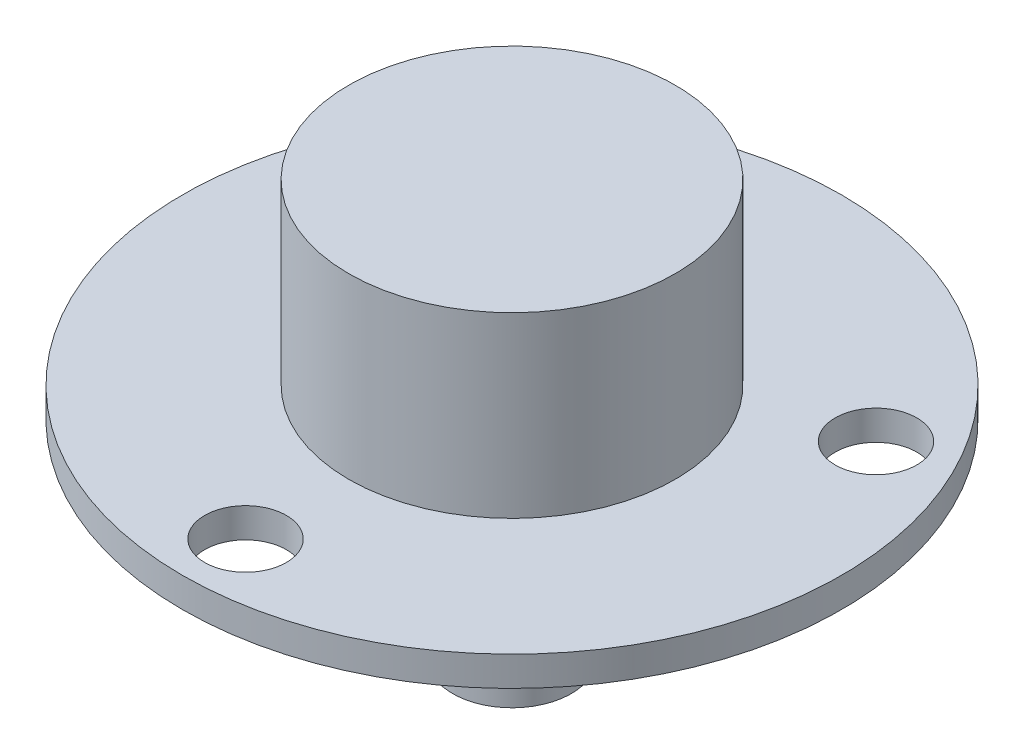
ISO-10303-21;
HEADER;
FILE_DESCRIPTION(('STEP AP214'),'2;1');
FILE_NAME('part.step','',(''),(''),'','','');
FILE_SCHEMA(('AUTOMOTIVE_DESIGN { 1 0 10303 214 1 1 1 1 }'));
ENDSEC;
DATA;
#1=APPLICATION_CONTEXT('core data for automotive mechanical design processes');
#2=APPLICATION_PROTOCOL_DEFINITION('international standard','automotive_design',2000,#1);
#3=PRODUCT_CONTEXT('',#1,'mechanical');
#4=PRODUCT('Part','Part','',(#3));
#5=PRODUCT_RELATED_PRODUCT_CATEGORY('part','',(#4));
#6=PRODUCT_DEFINITION_FORMATION('','',#4);
#7=PRODUCT_DEFINITION_CONTEXT('part definition',#1,'design');
#8=PRODUCT_DEFINITION('design','',#6,#7);
#9=PRODUCT_DEFINITION_SHAPE('','',#8);
#10=(LENGTH_UNIT() NAMED_UNIT(*) SI_UNIT(.MILLI.,.METRE.));
#11=(NAMED_UNIT(*) PLANE_ANGLE_UNIT() SI_UNIT($,.RADIAN.));
#12=(NAMED_UNIT(*) SI_UNIT($,.STERADIAN.) SOLID_ANGLE_UNIT());
#13=UNCERTAINTY_MEASURE_WITH_UNIT(LENGTH_MEASURE(1.E-05),#10,'distance_accuracy_value','');
#14=(GEOMETRIC_REPRESENTATION_CONTEXT(3) GLOBAL_UNCERTAINTY_ASSIGNED_CONTEXT((#13)) GLOBAL_UNIT_ASSIGNED_CONTEXT((#10,
#11,#12)) REPRESENTATION_CONTEXT('',''));
#15=CARTESIAN_POINT('',(0.,0.,0.));
#16=DIRECTION('',(0.,0.,1.));
#17=DIRECTION('',(1.,0.,0.));
#18=AXIS2_PLACEMENT_3D('',#15,#16,#17);
#19=CARTESIAN_POINT('',(0.,2.,0.));
#20=DIRECTION('',(0.,-1.,0.));
#21=DIRECTION('',(0.,0.,-1.));
#22=AXIS2_PLACEMENT_3D('',#19,#20,#21);
#23=CYLINDRICAL_SURFACE('',#22,22.2);
#24=CARTESIAN_POINT('',(0.,2.,0.));
#25=DIRECTION('',(0.,1.,0.));
#26=DIRECTION('',(0.,0.,1.));
#27=AXIS2_PLACEMENT_3D('',#24,#25,#26);
#28=CIRCLE('',#27,22.2);
#29=CARTESIAN_POINT('',(0.,2.,22.2));
#30=VERTEX_POINT('',#29);
#31=EDGE_CURVE('E42',#30,#30,#28,.T.);
#32=ORIENTED_EDGE('',*,*,#31,.F.);
#33=EDGE_LOOP('',(#32));
#34=FACE_BOUND('',#33,.T.);
#35=CARTESIAN_POINT('',(0.,0.,0.));
#36=DIRECTION('',(0.,1.,0.));
#37=DIRECTION('',(0.,0.,1.));
#38=AXIS2_PLACEMENT_3D('',#35,#36,#37);
#39=CIRCLE('',#38,22.2);
#40=CARTESIAN_POINT('',(0.,0.,22.2));
#41=VERTEX_POINT('',#40);
#42=EDGE_CURVE('E54',#41,#41,#39,.T.);
#43=ORIENTED_EDGE('',*,*,#42,.T.);
#44=EDGE_LOOP('',(#43));
#45=FACE_BOUND('',#44,.T.);
#46=ADVANCED_FACE('F30',(#34,#45),#23,.T.);
#47=CARTESIAN_POINT('',(0.,2.,0.));
#48=DIRECTION('',(0.,1.,0.));
#49=DIRECTION('',(0.,0.,1.));
#50=AXIS2_PLACEMENT_3D('',#47,#48,#49);
#51=PLANE('',#50);
#52=CARTESIAN_POINT('',(0.,2.,17.95));
#53=DIRECTION('',(0.,1.,0.));
#54=DIRECTION('',(0.,0.,1.));
#55=AXIS2_PLACEMENT_3D('',#52,#53,#54);
#56=CIRCLE('',#55,2.75);
#57=CARTESIAN_POINT('',(0.,2.,20.7));
#58=VERTEX_POINT('',#57);
#59=EDGE_CURVE('E65',#58,#58,#56,.T.);
#60=ORIENTED_EDGE('',*,*,#59,.F.);
#61=EDGE_LOOP('',(#60));
#62=FACE_BOUND('',#61,.T.);
#63=CARTESIAN_POINT('',(-15.5451559979306,2.,-8.97500000000008));
#64=DIRECTION('',(0.,1.,0.));
#65=DIRECTION('',(0.,0.,1.));
#66=AXIS2_PLACEMENT_3D('',#63,#64,#65);
#67=CIRCLE('',#66,2.75);
#68=CARTESIAN_POINT('',(-15.5451559979306,2.,-6.22500000000008));
#69=VERTEX_POINT('',#68);
#70=EDGE_CURVE('E188',#69,#69,#67,.T.);
#71=ORIENTED_EDGE('',*,*,#70,.F.);
#72=EDGE_LOOP('',(#71));
#73=FACE_BOUND('',#72,.T.);
#74=CARTESIAN_POINT('',(15.5451559979308,2.,-8.97499999999986));
#75=DIRECTION('',(0.,1.,0.));
#76=DIRECTION('',(0.,0.,1.));
#77=AXIS2_PLACEMENT_3D('',#74,#75,#76);
#78=CIRCLE('',#77,2.75);
#79=CARTESIAN_POINT('',(15.5451559979308,2.,-6.22499999999986));
#80=VERTEX_POINT('',#79);
#81=EDGE_CURVE('E191',#80,#80,#78,.T.);
#82=ORIENTED_EDGE('',*,*,#81,.F.);
#83=EDGE_LOOP('',(#82));
#84=FACE_BOUND('',#83,.T.);
#85=CARTESIAN_POINT('',(0.,2.,0.));
#86=DIRECTION('',(0.,1.,0.));
#87=DIRECTION('',(0.,0.,1.));
#88=AXIS2_PLACEMENT_3D('',#85,#86,#87);
#89=CIRCLE('',#88,11.);
#90=CARTESIAN_POINT('',(0.,2.,11.));
#91=VERTEX_POINT('',#90);
#92=EDGE_CURVE('E37',#91,#91,#89,.T.);
#93=ORIENTED_EDGE('',*,*,#92,.F.);
#94=EDGE_LOOP('',(#93));
#95=FACE_BOUND('',#94,.T.);
#96=ORIENTED_EDGE('',*,*,#31,.T.);
#97=EDGE_LOOP('',(#96));
#98=FACE_BOUND('',#97,.T.);
#99=ADVANCED_FACE('F91',(#62,#73,#84,#95,#98),#51,.T.);
#100=CARTESIAN_POINT('',(0.,0.,0.));
#101=DIRECTION('',(0.,1.,0.));
#102=DIRECTION('',(0.,0.,1.));
#103=AXIS2_PLACEMENT_3D('',#100,#101,#102);
#104=PLANE('',#103);
#105=CARTESIAN_POINT('',(0.,0.,17.95));
#106=DIRECTION('',(0.,1.,0.));
#107=DIRECTION('',(0.,0.,1.));
#108=AXIS2_PLACEMENT_3D('',#105,#106,#107);
#109=CIRCLE('',#108,2.75);
#110=CARTESIAN_POINT('',(0.,0.,20.7));
#111=VERTEX_POINT('',#110);
#112=EDGE_CURVE('E33',#111,#111,#109,.T.);
#113=ORIENTED_EDGE('',*,*,#112,.T.);
#114=EDGE_LOOP('',(#113));
#115=FACE_BOUND('',#114,.T.);
#116=CARTESIAN_POINT('',(-15.5451559979306,0.,-8.97500000000008));
#117=DIRECTION('',(0.,1.,0.));
#118=DIRECTION('',(0.,0.,1.));
#119=AXIS2_PLACEMENT_3D('',#116,#117,#118);
#120=CIRCLE('',#119,2.75);
#121=CARTESIAN_POINT('',(-15.5451559979306,0.,-6.22500000000008));
#122=VERTEX_POINT('',#121);
#123=EDGE_CURVE('E64',#122,#122,#120,.T.);
#124=ORIENTED_EDGE('',*,*,#123,.T.);
#125=EDGE_LOOP('',(#124));
#126=FACE_BOUND('',#125,.T.);
#127=CARTESIAN_POINT('',(15.5451559979308,0.,-8.97499999999986));
#128=DIRECTION('',(0.,1.,0.));
#129=DIRECTION('',(0.,0.,1.));
#130=AXIS2_PLACEMENT_3D('',#127,#128,#129);
#131=CIRCLE('',#130,2.75);
#132=CARTESIAN_POINT('',(15.5451559979308,0.,-6.22499999999986));
#133=VERTEX_POINT('',#132);
#134=EDGE_CURVE('E62',#133,#133,#131,.T.);
#135=ORIENTED_EDGE('',*,*,#134,.T.);
#136=EDGE_LOOP('',(#135));
#137=FACE_BOUND('',#136,.T.);
#138=CARTESIAN_POINT('',(0.,0.,0.));
#139=DIRECTION('',(0.,1.,0.));
#140=DIRECTION('',(0.,0.,1.));
#141=AXIS2_PLACEMENT_3D('',#138,#139,#140);
#142=CIRCLE('',#141,11.);
#143=CARTESIAN_POINT('',(0.,0.,11.));
#144=VERTEX_POINT('',#143);
#145=EDGE_CURVE('E51',#144,#144,#142,.T.);
#146=ORIENTED_EDGE('',*,*,#145,.T.);
#147=EDGE_LOOP('',(#146));
#148=FACE_BOUND('',#147,.T.);
#149=ORIENTED_EDGE('',*,*,#42,.F.);
#150=EDGE_LOOP('',(#149));
#151=FACE_BOUND('',#150,.T.);
#152=ADVANCED_FACE('F96',(#115,#126,#137,#148,#151),#104,.F.);
#153=CARTESIAN_POINT('',(0.,14.,0.));
#154=DIRECTION('',(0.,-1.,0.));
#155=DIRECTION('',(0.,0.,-1.));
#156=AXIS2_PLACEMENT_3D('',#153,#154,#155);
#157=CYLINDRICAL_SURFACE('',#156,11.);
#158=CARTESIAN_POINT('',(0.,14.,0.));
#159=DIRECTION('',(0.,1.,0.));
#160=DIRECTION('',(0.,0.,1.));
#161=AXIS2_PLACEMENT_3D('',#158,#159,#160);
#162=CIRCLE('',#161,11.);
#163=CARTESIAN_POINT('',(0.,14.,11.));
#164=VERTEX_POINT('',#163);
#165=EDGE_CURVE('E52',#164,#164,#162,.T.);
#166=ORIENTED_EDGE('',*,*,#165,.F.);
#167=EDGE_LOOP('',(#166));
#168=FACE_BOUND('',#167,.T.);
#169=ORIENTED_EDGE('',*,*,#92,.T.);
#170=EDGE_LOOP('',(#169));
#171=FACE_BOUND('',#170,.T.);
#172=ADVANCED_FACE('F104',(#168,#171),#157,.T.);
#173=CARTESIAN_POINT('',(0.,14.,0.));
#174=DIRECTION('',(0.,1.,0.));
#175=DIRECTION('',(0.,0.,1.));
#176=AXIS2_PLACEMENT_3D('',#173,#174,#175);
#177=PLANE('',#176);
#178=ORIENTED_EDGE('',*,*,#165,.T.);
#179=EDGE_LOOP('',(#178));
#180=FACE_BOUND('',#179,.T.);
#181=ADVANCED_FACE('F108',(#180),#177,.T.);
#182=CARTESIAN_POINT('',(0.,-5.,0.));
#183=DIRECTION('',(0.,1.,0.));
#184=DIRECTION('',(0.,0.,1.));
#185=AXIS2_PLACEMENT_3D('',#182,#183,#184);
#186=CYLINDRICAL_SURFACE('',#185,11.);
#187=CARTESIAN_POINT('',(0.,-5.,0.));
#188=DIRECTION('',(0.,1.,0.));
#189=DIRECTION('',(0.,0.,1.));
#190=AXIS2_PLACEMENT_3D('',#187,#188,#189);
#191=CIRCLE('',#190,11.);
#192=CARTESIAN_POINT('',(0.,-5.,11.));
#193=VERTEX_POINT('',#192);
#194=EDGE_CURVE('E48',#193,#193,#191,.T.);
#195=ORIENTED_EDGE('',*,*,#194,.T.);
#196=EDGE_LOOP('',(#195));
#197=FACE_BOUND('',#196,.T.);
#198=ORIENTED_EDGE('',*,*,#145,.F.);
#199=EDGE_LOOP('',(#198));
#200=FACE_BOUND('',#199,.T.);
#201=ADVANCED_FACE('F87',(#197,#200),#186,.T.);
#202=CARTESIAN_POINT('',(0.,-5.,0.));
#203=DIRECTION('',(0.,1.,0.));
#204=DIRECTION('',(0.,0.,1.));
#205=AXIS2_PLACEMENT_3D('',#202,#203,#204);
#206=PLANE('',#205);
#207=CARTESIAN_POINT('',(0.,-5.,0.));
#208=DIRECTION('',(0.,-1.,0.));
#209=DIRECTION('',(0.,0.,-1.));
#210=AXIS2_PLACEMENT_3D('',#207,#208,#209);
#211=CIRCLE('',#210,4.);
#212=CARTESIAN_POINT('',(0.,-5.,-4.));
#213=VERTEX_POINT('',#212);
#214=EDGE_CURVE('E10',#213,#213,#211,.T.);
#215=ORIENTED_EDGE('',*,*,#214,.F.);
#216=EDGE_LOOP('',(#215));
#217=FACE_BOUND('',#216,.T.);
#218=ORIENTED_EDGE('',*,*,#194,.F.);
#219=EDGE_LOOP('',(#218));
#220=FACE_BOUND('',#219,.T.);
#221=ADVANCED_FACE('F79',(#217,#220),#206,.F.);
#222=CARTESIAN_POINT('',(0.,-14.,0.));
#223=DIRECTION('',(0.,1.,0.));
#224=DIRECTION('',(0.,0.,1.));
#225=AXIS2_PLACEMENT_3D('',#222,#223,#224);
#226=CYLINDRICAL_SURFACE('',#225,4.);
#227=CARTESIAN_POINT('',(0.,-14.,0.));
#228=DIRECTION('',(0.,-1.,0.));
#229=DIRECTION('',(0.,0.,-1.));
#230=AXIS2_PLACEMENT_3D('',#227,#228,#229);
#231=CIRCLE('',#230,4.);
#232=CARTESIAN_POINT('',(0.,-14.,-4.));
#233=VERTEX_POINT('',#232);
#234=EDGE_CURVE('E46',#233,#233,#231,.T.);
#235=ORIENTED_EDGE('',*,*,#234,.F.);
#236=EDGE_LOOP('',(#235));
#237=FACE_BOUND('',#236,.T.);
#238=ORIENTED_EDGE('',*,*,#214,.T.);
#239=EDGE_LOOP('',(#238));
#240=FACE_BOUND('',#239,.T.);
#241=ADVANCED_FACE('F77',(#237,#240),#226,.T.);
#242=CARTESIAN_POINT('',(0.,-14.,0.));
#243=DIRECTION('',(0.,-1.,0.));
#244=DIRECTION('',(0.,0.,-1.));
#245=AXIS2_PLACEMENT_3D('',#242,#243,#244);
#246=PLANE('',#245);
#247=ORIENTED_EDGE('',*,*,#234,.T.);
#248=EDGE_LOOP('',(#247));
#249=FACE_BOUND('',#248,.T.);
#250=ADVANCED_FACE('F75',(#249),#246,.T.);
#251=CARTESIAN_POINT('',(15.5451559979308,-1.1,-8.97499999999986));
#252=DIRECTION('',(0.,1.,0.));
#253=DIRECTION('',(0.,0.,1.));
#254=AXIS2_PLACEMENT_3D('',#251,#252,#253);
#255=CYLINDRICAL_SURFACE('',#254,2.75);
#256=ORIENTED_EDGE('',*,*,#81,.T.);
#257=EDGE_LOOP('',(#256));
#258=FACE_BOUND('',#257,.T.);
#259=ORIENTED_EDGE('',*,*,#134,.F.);
#260=EDGE_LOOP('',(#259));
#261=FACE_BOUND('',#260,.T.);
#262=ADVANCED_FACE('F85',(#258,#261),#255,.F.);
#263=CARTESIAN_POINT('',(-15.5451559979306,-1.1,-8.97500000000008));
#264=DIRECTION('',(0.,1.,0.));
#265=DIRECTION('',(0.,0.,1.));
#266=AXIS2_PLACEMENT_3D('',#263,#264,#265);
#267=CYLINDRICAL_SURFACE('',#266,2.75);
#268=ORIENTED_EDGE('',*,*,#70,.T.);
#269=EDGE_LOOP('',(#268));
#270=FACE_BOUND('',#269,.T.);
#271=ORIENTED_EDGE('',*,*,#123,.F.);
#272=EDGE_LOOP('',(#271));
#273=FACE_BOUND('',#272,.T.);
#274=ADVANCED_FACE('F161',(#270,#273),#267,.F.);
#275=CARTESIAN_POINT('',(0.,-1.1,17.95));
#276=DIRECTION('',(0.,1.,0.));
#277=DIRECTION('',(0.,0.,1.));
#278=AXIS2_PLACEMENT_3D('',#275,#276,#277);
#279=CYLINDRICAL_SURFACE('',#278,2.75);
#280=ORIENTED_EDGE('',*,*,#59,.T.);
#281=EDGE_LOOP('',(#280));
#282=FACE_BOUND('',#281,.T.);
#283=ORIENTED_EDGE('',*,*,#112,.F.);
#284=EDGE_LOOP('',(#283));
#285=FACE_BOUND('',#284,.T.);
#286=ADVANCED_FACE('F171',(#282,#285),#279,.F.);
#287=CLOSED_SHELL('',(#46,#99,#152,#172,#181,#201,#221,#241,#250,#262,#274,#286));
#288=MANIFOLD_SOLID_BREP('B2',#287);
#289=ADVANCED_BREP_SHAPE_REPRESENTATION('',(#18,#288),#14);
#290=SHAPE_DEFINITION_REPRESENTATION(#9,#289);
ENDSEC;
END-ISO-10303-21;
